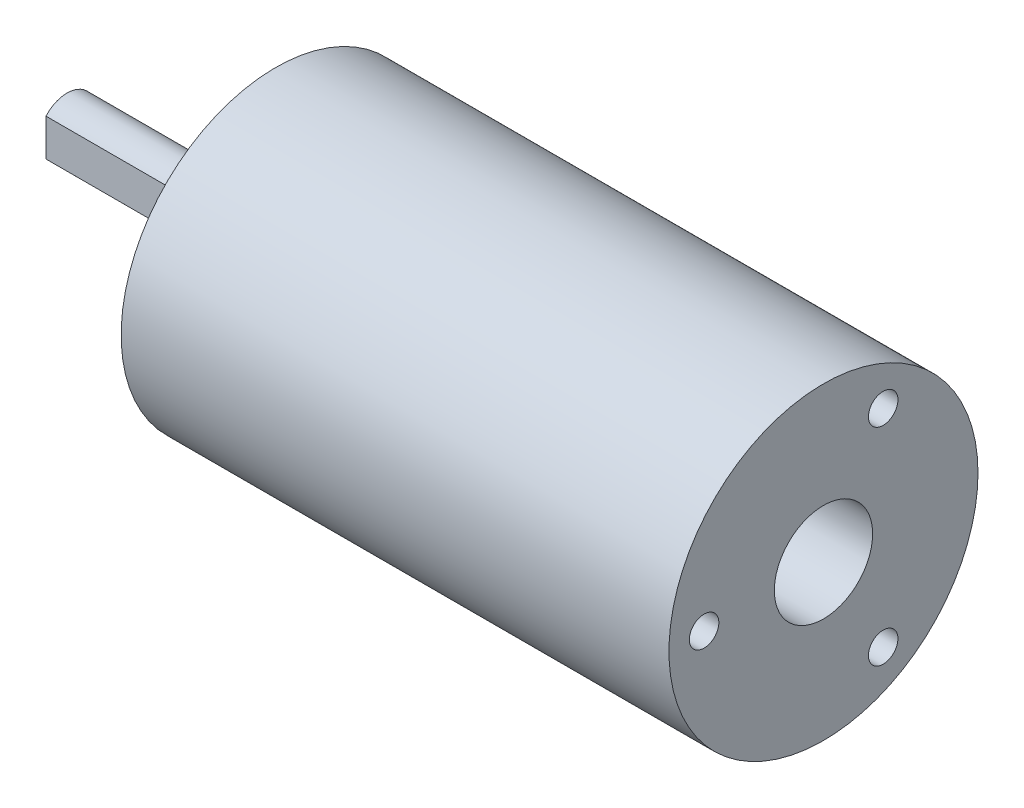
ISO-10303-21;
HEADER;
FILE_DESCRIPTION(('STEP AP214'),'2;1');
FILE_NAME('part.step','',(''),(''),'','','');
FILE_SCHEMA(('AUTOMOTIVE_DESIGN { 1 0 10303 214 1 1 1 1 }'));
ENDSEC;
DATA;
#1=APPLICATION_CONTEXT('core data for automotive mechanical design processes');
#2=APPLICATION_PROTOCOL_DEFINITION('international standard','automotive_design',2000,#1);
#3=PRODUCT_CONTEXT('',#1,'mechanical');
#4=PRODUCT('Part','Part','',(#3));
#5=PRODUCT_RELATED_PRODUCT_CATEGORY('part','',(#4));
#6=PRODUCT_DEFINITION_FORMATION('','',#4);
#7=PRODUCT_DEFINITION_CONTEXT('part definition',#1,'design');
#8=PRODUCT_DEFINITION('design','',#6,#7);
#9=PRODUCT_DEFINITION_SHAPE('','',#8);
#10=(LENGTH_UNIT() NAMED_UNIT(*) SI_UNIT(.MILLI.,.METRE.));
#11=(NAMED_UNIT(*) PLANE_ANGLE_UNIT() SI_UNIT($,.RADIAN.));
#12=(NAMED_UNIT(*) SI_UNIT($,.STERADIAN.) SOLID_ANGLE_UNIT());
#13=UNCERTAINTY_MEASURE_WITH_UNIT(LENGTH_MEASURE(1.E-05),#10,'distance_accuracy_value','');
#14=(GEOMETRIC_REPRESENTATION_CONTEXT(3) GLOBAL_UNCERTAINTY_ASSIGNED_CONTEXT((#13)) GLOBAL_UNIT_ASSIGNED_CONTEXT((#10,
#11,#12)) REPRESENTATION_CONTEXT('',''));
#15=CARTESIAN_POINT('',(0.,0.,0.));
#16=DIRECTION('',(0.,0.,1.));
#17=DIRECTION('',(1.,0.,0.));
#18=AXIS2_PLACEMENT_3D('',#15,#16,#17);
#19=CARTESIAN_POINT('',(-5.85,-1.32287565553,1.5));
#20=DIRECTION('',(-0.707106781186547,0.,0.707106781186548));
#21=DIRECTION('',(0.707106781186548,0.,0.707106781186547));
#22=AXIS2_PLACEMENT_3D('',#19,#20,#21);
#23=PLANE('',#22);
#24=CARTESIAN_POINT('',(-7.35,0.,0.));
#25=DIRECTION('',(-0.707106781186547,0.,0.707106781186548));
#26=DIRECTION('',(-0.707106781186548,0.,-0.707106781186547));
#27=AXIS2_PLACEMENT_3D('',#24,#25,#26);
#28=ELLIPSE('',#27,2.82842712474619,2.);
#29=CARTESIAN_POINT('',(-5.84999999999943,1.32287565553165,1.50000000000057));
#30=VERTEX_POINT('',#29);
#31=CARTESIAN_POINT('',(-5.84999999999943,-1.32287565553165,1.50000000000057));
#32=VERTEX_POINT('',#31);
#33=EDGE_CURVE('E19',#30,#32,#28,.F.);
#34=ORIENTED_EDGE('',*,*,#33,.F.);
#35=DIRECTION('',(0.,1.,0.));
#36=VECTOR('',#35,1.);
#37=CARTESIAN_POINT('',(-5.85,1.32287565553,1.5));
#38=LINE('',#37,#36);
#39=EDGE_CURVE('E40',#32,#30,#38,.T.);
#40=ORIENTED_EDGE('',*,*,#39,.F.);
#41=EDGE_LOOP('',(#34,#40));
#42=FACE_BOUND('',#41,.T.);
#43=ADVANCED_FACE('F16',(#42),#23,.T.);
#44=CARTESIAN_POINT('',(-14.85,1.32287565553,1.5));
#45=DIRECTION('',(0.,0.,1.));
#46=DIRECTION('',(1.,0.,0.));
#47=AXIS2_PLACEMENT_3D('',#44,#45,#46);
#48=PLANE('',#47);
#49=ORIENTED_EDGE('',*,*,#39,.T.);
#50=DIRECTION('',(-1.,0.,0.));
#51=VECTOR('',#50,1.);
#52=CARTESIAN_POINT('',(-3.14999999,1.322875655531,1.50000000000114));
#53=LINE('',#52,#51);
#54=CARTESIAN_POINT('',(-14.85,1.32287565553165,1.50000000000057));
#55=VERTEX_POINT('',#54);
#56=EDGE_CURVE('E44',#55,#30,#53,.F.);
#57=ORIENTED_EDGE('',*,*,#56,.F.);
#58=DIRECTION('',(0.,-1.,0.));
#59=VECTOR('',#58,1.);
#60=CARTESIAN_POINT('',(-14.85,1.32287565553,1.5));
#61=LINE('',#60,#59);
#62=CARTESIAN_POINT('',(-14.85,-1.32287565553165,1.50000000000057));
#63=VERTEX_POINT('',#62);
#64=EDGE_CURVE('E33',#63,#55,#61,.F.);
#65=ORIENTED_EDGE('',*,*,#64,.F.);
#66=DIRECTION('',(-1.,0.,0.));
#67=VECTOR('',#66,1.);
#68=CARTESIAN_POINT('',(-3.14999999,-1.322875655531,1.50000000000114));
#69=LINE('',#68,#67);
#70=EDGE_CURVE('E46',#32,#63,#69,.T.);
#71=ORIENTED_EDGE('',*,*,#70,.F.);
#72=EDGE_LOOP('',(#49,#57,#65,#71));
#73=FACE_BOUND('',#72,.T.);
#74=ADVANCED_FACE('F42',(#73),#48,.T.);
#75=CARTESIAN_POINT('',(-14.85,1.32287565553,1.5));
#76=DIRECTION('',(-1.,0.,0.));
#77=DIRECTION('',(0.,-1.,0.));
#78=AXIS2_PLACEMENT_3D('',#75,#76,#77);
#79=PLANE('',#78);
#80=ORIENTED_EDGE('',*,*,#64,.T.);
#81=CARTESIAN_POINT('',(-14.85,0.,0.));
#82=DIRECTION('',(-1.,0.,0.));
#83=DIRECTION('',(0.,0.,1.));
#84=AXIS2_PLACEMENT_3D('',#81,#82,#83);
#85=CIRCLE('',#84,2.);
#86=EDGE_CURVE('E53',#63,#55,#85,.F.);
#87=ORIENTED_EDGE('',*,*,#86,.F.);
#88=EDGE_LOOP('',(#80,#87));
#89=FACE_BOUND('',#88,.T.);
#90=ADVANCED_FACE('F122',(#89),#79,.T.);
#91=CARTESIAN_POINT('',(-3.14999999,0.,0.));
#92=DIRECTION('',(-1.,0.,0.));
#93=DIRECTION('',(0.,0.,1.));
#94=AXIS2_PLACEMENT_3D('',#91,#92,#93);
#95=CYLINDRICAL_SURFACE('',#94,2.);
#96=CARTESIAN_POINT('',(-3.15,0.,0.));
#97=DIRECTION('',(-1.,0.,0.));
#98=DIRECTION('',(0.,0.,1.));
#99=AXIS2_PLACEMENT_3D('',#96,#97,#98);
#100=CIRCLE('',#99,2.);
#101=CARTESIAN_POINT('',(-3.15,0.,2.));
#102=VERTEX_POINT('',#101);
#103=EDGE_CURVE('E114',#102,#102,#100,.F.);
#104=ORIENTED_EDGE('',*,*,#103,.F.);
#105=EDGE_LOOP('',(#104));
#106=FACE_BOUND('',#105,.T.);
#107=ORIENTED_EDGE('',*,*,#70,.T.);
#108=ORIENTED_EDGE('',*,*,#86,.T.);
#109=ORIENTED_EDGE('',*,*,#56,.T.);
#110=ORIENTED_EDGE('',*,*,#33,.T.);
#111=EDGE_LOOP('',(#107,#108,#109,#110));
#112=FACE_BOUND('',#111,.T.);
#113=ADVANCED_FACE('F52',(#106,#112),#95,.T.);
#114=CARTESIAN_POINT('',(-3.15,-3.5,0.));
#115=DIRECTION('',(-1.,0.,0.));
#116=DIRECTION('',(0.,-1.,0.));
#117=AXIS2_PLACEMENT_3D('',#114,#115,#116);
#118=PLANE('',#117);
#119=ORIENTED_EDGE('',*,*,#103,.T.);
#120=EDGE_LOOP('',(#119));
#121=FACE_BOUND('',#120,.T.);
#122=CARTESIAN_POINT('',(-3.15,0.,0.));
#123=DIRECTION('',(-1.,0.,0.));
#124=DIRECTION('',(0.,-1.,0.));
#125=AXIS2_PLACEMENT_3D('',#122,#123,#124);
#126=CIRCLE('',#125,3.5);
#127=CARTESIAN_POINT('',(-3.15,-3.5,0.));
#128=VERTEX_POINT('',#127);
#129=EDGE_CURVE('E111',#128,#128,#126,.F.);
#130=ORIENTED_EDGE('',*,*,#129,.F.);
#131=EDGE_LOOP('',(#130));
#132=FACE_BOUND('',#131,.T.);
#133=ADVANCED_FACE('F118',(#121,#132),#118,.T.);
#134=CARTESIAN_POINT('',(-1.34999999,0.,0.));
#135=DIRECTION('',(-1.,0.,0.));
#136=DIRECTION('',(0.,-1.,0.));
#137=AXIS2_PLACEMENT_3D('',#134,#135,#136);
#138=CYLINDRICAL_SURFACE('',#137,3.5);
#139=ORIENTED_EDGE('',*,*,#129,.T.);
#140=EDGE_LOOP('',(#139));
#141=FACE_BOUND('',#140,.T.);
#142=CARTESIAN_POINT('',(-1.35,0.,0.));
#143=DIRECTION('',(-1.,0.,0.));
#144=DIRECTION('',(0.,-1.,0.));
#145=AXIS2_PLACEMENT_3D('',#142,#143,#144);
#146=CIRCLE('',#145,3.5);
#147=CARTESIAN_POINT('',(-1.35,-3.5,0.));
#148=VERTEX_POINT('',#147);
#149=EDGE_CURVE('E108',#148,#148,#146,.F.);
#150=ORIENTED_EDGE('',*,*,#149,.F.);
#151=EDGE_LOOP('',(#150));
#152=FACE_BOUND('',#151,.T.);
#153=ADVANCED_FACE('F129',(#141,#152),#138,.T.);
#154=CARTESIAN_POINT('',(36.,7.88621593217,-3.34067332603));
#155=DIRECTION('',(1.,0.,0.));
#156=DIRECTION('',(0.,0.,-1.));
#157=AXIS2_PLACEMENT_3D('',#154,#155,#156);
#158=PLANE('',#157);
#159=CARTESIAN_POINT('',(36.,7.36121593217,-4.25));
#160=DIRECTION('',(-1.,0.,0.));
#161=DIRECTION('',(0.,-1.,0.));
#162=AXIS2_PLACEMENT_3D('',#159,#160,#161);
#163=CIRCLE('',#162,1.05);
#164=CARTESIAN_POINT('',(36.,6.31121593217,-4.25));
#165=VERTEX_POINT('',#164);
#166=EDGE_CURVE('E105',#165,#165,#163,.F.);
#167=ORIENTED_EDGE('',*,*,#166,.T.);
#168=EDGE_LOOP('',(#167));
#169=FACE_BOUND('',#168,.T.);
#170=ADVANCED_FACE('F208',(#169),#158,.T.);
#171=CARTESIAN_POINT('',(36.,-6.83621593217,-5.15932667397));
#172=DIRECTION('',(1.,0.,0.));
#173=DIRECTION('',(0.,0.,-1.));
#174=AXIS2_PLACEMENT_3D('',#171,#172,#173);
#175=PLANE('',#174);
#176=CARTESIAN_POINT('',(36.,-7.36121593217,-4.25));
#177=DIRECTION('',(-1.,0.,0.));
#178=DIRECTION('',(0.,-1.,0.));
#179=AXIS2_PLACEMENT_3D('',#176,#177,#178);
#180=CIRCLE('',#179,1.05);
#181=CARTESIAN_POINT('',(36.,-8.41121593217,-4.25));
#182=VERTEX_POINT('',#181);
#183=EDGE_CURVE('E102',#182,#182,#180,.F.);
#184=ORIENTED_EDGE('',*,*,#183,.T.);
#185=EDGE_LOOP('',(#184));
#186=FACE_BOUND('',#185,.T.);
#187=ADVANCED_FACE('F204',(#186),#175,.T.);
#188=CARTESIAN_POINT('',(36.,1.05,8.5));
#189=DIRECTION('',(1.,0.,0.));
#190=DIRECTION('',(0.,0.,-1.));
#191=AXIS2_PLACEMENT_3D('',#188,#189,#190);
#192=PLANE('',#191);
#193=CARTESIAN_POINT('',(36.,0.,8.5));
#194=DIRECTION('',(-1.,0.,0.));
#195=DIRECTION('',(0.,-1.,0.));
#196=AXIS2_PLACEMENT_3D('',#193,#194,#195);
#197=CIRCLE('',#196,1.05);
#198=CARTESIAN_POINT('',(36.,-1.05,8.5));
#199=VERTEX_POINT('',#198);
#200=EDGE_CURVE('E99',#199,#199,#197,.F.);
#201=ORIENTED_EDGE('',*,*,#200,.T.);
#202=EDGE_LOOP('',(#201));
#203=FACE_BOUND('',#202,.T.);
#204=ADVANCED_FACE('F200',(#203),#192,.T.);
#205=CARTESIAN_POINT('',(32.6,3.5,0.));
#206=DIRECTION('',(1.,0.,0.));
#207=DIRECTION('',(0.,0.,-1.));
#208=AXIS2_PLACEMENT_3D('',#205,#206,#207);
#209=PLANE('',#208);
#210=CARTESIAN_POINT('',(32.6,0.,0.));
#211=DIRECTION('',(-1.,0.,0.));
#212=DIRECTION('',(0.,-1.,0.));
#213=AXIS2_PLACEMENT_3D('',#210,#211,#212);
#214=CIRCLE('',#213,3.5);
#215=CARTESIAN_POINT('',(32.6,-3.5,0.));
#216=VERTEX_POINT('',#215);
#217=EDGE_CURVE('E96',#216,#216,#214,.F.);
#218=ORIENTED_EDGE('',*,*,#217,.T.);
#219=EDGE_LOOP('',(#218));
#220=FACE_BOUND('',#219,.T.);
#221=ADVANCED_FACE('F196',(#220),#209,.T.);
#222=CARTESIAN_POINT('',(6.5,6.54967782649,-2.65562523131));
#223=DIRECTION('',(-1.,0.,0.));
#224=DIRECTION('',(0.,-1.,0.));
#225=AXIS2_PLACEMENT_3D('',#222,#223,#224);
#226=PLANE('',#225);
#227=CARTESIAN_POINT('',(6.5,6.06217782649,-3.5));
#228=DIRECTION('',(1.,0.,0.));
#229=DIRECTION('',(0.,0.,-1.));
#230=AXIS2_PLACEMENT_3D('',#227,#228,#229);
#231=CIRCLE('',#230,0.975);
#232=CARTESIAN_POINT('',(6.5,6.06217782649,-4.475));
#233=VERTEX_POINT('',#232);
#234=EDGE_CURVE('E93',#233,#233,#231,.F.);
#235=ORIENTED_EDGE('',*,*,#234,.T.);
#236=EDGE_LOOP('',(#235));
#237=FACE_BOUND('',#236,.T.);
#238=ADVANCED_FACE('F192',(#237),#226,.T.);
#239=CARTESIAN_POINT('',(6.5,-5.57467782649,-4.34437476869));
#240=DIRECTION('',(-1.,0.,0.));
#241=DIRECTION('',(0.,-1.,0.));
#242=AXIS2_PLACEMENT_3D('',#239,#240,#241);
#243=PLANE('',#242);
#244=CARTESIAN_POINT('',(6.5,-6.06217782649,-3.5));
#245=DIRECTION('',(1.,0.,0.));
#246=DIRECTION('',(0.,0.,-1.));
#247=AXIS2_PLACEMENT_3D('',#244,#245,#246);
#248=CIRCLE('',#247,0.975);
#249=CARTESIAN_POINT('',(6.5,-6.06217782649,-4.475));
#250=VERTEX_POINT('',#249);
#251=EDGE_CURVE('E90',#250,#250,#248,.F.);
#252=ORIENTED_EDGE('',*,*,#251,.T.);
#253=EDGE_LOOP('',(#252));
#254=FACE_BOUND('',#253,.T.);
#255=ADVANCED_FACE('F188',(#254),#243,.T.);
#256=CARTESIAN_POINT('',(6.5,0.975,7.));
#257=DIRECTION('',(-1.,0.,0.));
#258=DIRECTION('',(0.,-1.,0.));
#259=AXIS2_PLACEMENT_3D('',#256,#257,#258);
#260=PLANE('',#259);
#261=CARTESIAN_POINT('',(6.5,0.,7.));
#262=DIRECTION('',(1.,0.,0.));
#263=DIRECTION('',(0.,0.,-1.));
#264=AXIS2_PLACEMENT_3D('',#261,#262,#263);
#265=CIRCLE('',#264,0.975);
#266=CARTESIAN_POINT('',(6.5,0.,6.025));
#267=VERTEX_POINT('',#266);
#268=EDGE_CURVE('E87',#267,#267,#265,.F.);
#269=ORIENTED_EDGE('',*,*,#268,.T.);
#270=EDGE_LOOP('',(#269));
#271=FACE_BOUND('',#270,.T.);
#272=ADVANCED_FACE('F184',(#271),#260,.T.);
#273=CARTESIAN_POINT('',(-1.35,5.,0.));
#274=DIRECTION('',(-1.,0.,0.));
#275=DIRECTION('',(0.,-1.,0.));
#276=AXIS2_PLACEMENT_3D('',#273,#274,#275);
#277=PLANE('',#276);
#278=ORIENTED_EDGE('',*,*,#149,.T.);
#279=EDGE_LOOP('',(#278));
#280=FACE_BOUND('',#279,.T.);
#281=CARTESIAN_POINT('',(-1.35,0.,0.));
#282=DIRECTION('',(1.,0.,0.));
#283=DIRECTION('',(0.,0.,-1.));
#284=AXIS2_PLACEMENT_3D('',#281,#282,#283);
#285=CIRCLE('',#284,5.);
#286=CARTESIAN_POINT('',(-1.35,0.,-5.));
#287=VERTEX_POINT('',#286);
#288=EDGE_CURVE('E84',#287,#287,#285,.T.);
#289=ORIENTED_EDGE('',*,*,#288,.F.);
#290=EDGE_LOOP('',(#289));
#291=FACE_BOUND('',#290,.T.);
#292=ADVANCED_FACE('F180',(#280,#291),#277,.T.);
#293=CARTESIAN_POINT('',(39.00000001,7.36121593217,-4.25));
#294=DIRECTION('',(-1.,0.,0.));
#295=DIRECTION('',(0.,-1.,0.));
#296=AXIS2_PLACEMENT_3D('',#293,#294,#295);
#297=CYLINDRICAL_SURFACE('',#296,1.05);
#298=ORIENTED_EDGE('',*,*,#166,.F.);
#299=EDGE_LOOP('',(#298));
#300=FACE_BOUND('',#299,.T.);
#301=CARTESIAN_POINT('',(39.,7.36121593217,-4.25));
#302=DIRECTION('',(-1.,0.,0.));
#303=DIRECTION('',(0.,-1.,0.));
#304=AXIS2_PLACEMENT_3D('',#301,#302,#303);
#305=CIRCLE('',#304,1.05);
#306=CARTESIAN_POINT('',(39.,6.31121593217,-4.25));
#307=VERTEX_POINT('',#306);
#308=EDGE_CURVE('E81',#307,#307,#305,.T.);
#309=ORIENTED_EDGE('',*,*,#308,.F.);
#310=EDGE_LOOP('',(#309));
#311=FACE_BOUND('',#310,.T.);
#312=ADVANCED_FACE('F176',(#300,#311),#297,.F.);
#313=CARTESIAN_POINT('',(39.00000001,-7.36121593217,-4.25));
#314=DIRECTION('',(-1.,0.,0.));
#315=DIRECTION('',(0.,-1.,0.));
#316=AXIS2_PLACEMENT_3D('',#313,#314,#315);
#317=CYLINDRICAL_SURFACE('',#316,1.05);
#318=ORIENTED_EDGE('',*,*,#183,.F.);
#319=EDGE_LOOP('',(#318));
#320=FACE_BOUND('',#319,.T.);
#321=CARTESIAN_POINT('',(39.,-7.36121593217,-4.25));
#322=DIRECTION('',(-1.,0.,0.));
#323=DIRECTION('',(0.,-1.,0.));
#324=AXIS2_PLACEMENT_3D('',#321,#322,#323);
#325=CIRCLE('',#324,1.05);
#326=CARTESIAN_POINT('',(39.,-8.41121593217,-4.25));
#327=VERTEX_POINT('',#326);
#328=EDGE_CURVE('E78',#327,#327,#325,.T.);
#329=ORIENTED_EDGE('',*,*,#328,.F.);
#330=EDGE_LOOP('',(#329));
#331=FACE_BOUND('',#330,.T.);
#332=ADVANCED_FACE('F172',(#320,#331),#317,.F.);
#333=CARTESIAN_POINT('',(39.00000001,0.,8.5));
#334=DIRECTION('',(-1.,0.,0.));
#335=DIRECTION('',(0.,-1.,0.));
#336=AXIS2_PLACEMENT_3D('',#333,#334,#335);
#337=CYLINDRICAL_SURFACE('',#336,1.05);
#338=ORIENTED_EDGE('',*,*,#200,.F.);
#339=EDGE_LOOP('',(#338));
#340=FACE_BOUND('',#339,.T.);
#341=CARTESIAN_POINT('',(39.,0.,8.5));
#342=DIRECTION('',(-1.,0.,0.));
#343=DIRECTION('',(0.,-1.,0.));
#344=AXIS2_PLACEMENT_3D('',#341,#342,#343);
#345=CIRCLE('',#344,1.05);
#346=CARTESIAN_POINT('',(39.,-1.05,8.5));
#347=VERTEX_POINT('',#346);
#348=EDGE_CURVE('E75',#347,#347,#345,.T.);
#349=ORIENTED_EDGE('',*,*,#348,.F.);
#350=EDGE_LOOP('',(#349));
#351=FACE_BOUND('',#350,.T.);
#352=ADVANCED_FACE('F168',(#340,#351),#337,.F.);
#353=CARTESIAN_POINT('',(39.00000001,0.,0.));
#354=DIRECTION('',(-1.,0.,0.));
#355=DIRECTION('',(0.,-1.,0.));
#356=AXIS2_PLACEMENT_3D('',#353,#354,#355);
#357=CYLINDRICAL_SURFACE('',#356,3.5);
#358=ORIENTED_EDGE('',*,*,#217,.F.);
#359=EDGE_LOOP('',(#358));
#360=FACE_BOUND('',#359,.T.);
#361=CARTESIAN_POINT('',(39.,0.,0.));
#362=DIRECTION('',(-1.,0.,0.));
#363=DIRECTION('',(0.,-1.,0.));
#364=AXIS2_PLACEMENT_3D('',#361,#362,#363);
#365=CIRCLE('',#364,3.5);
#366=CARTESIAN_POINT('',(39.,-3.5,0.));
#367=VERTEX_POINT('',#366);
#368=EDGE_CURVE('E72',#367,#367,#365,.T.);
#369=ORIENTED_EDGE('',*,*,#368,.F.);
#370=EDGE_LOOP('',(#369));
#371=FACE_BOUND('',#370,.T.);
#372=ADVANCED_FACE('F164',(#360,#371),#357,.F.);
#373=CARTESIAN_POINT('',(-9.99999993922529E-09,6.06217782649,-3.5));
#374=DIRECTION('',(1.,0.,0.));
#375=DIRECTION('',(0.,0.,-1.));
#376=AXIS2_PLACEMENT_3D('',#373,#374,#375);
#377=CYLINDRICAL_SURFACE('',#376,0.975);
#378=ORIENTED_EDGE('',*,*,#234,.F.);
#379=EDGE_LOOP('',(#378));
#380=FACE_BOUND('',#379,.T.);
#381=CARTESIAN_POINT('',(0.,6.06217782649,-3.5));
#382=DIRECTION('',(1.,0.,0.));
#383=DIRECTION('',(0.,0.,-1.));
#384=AXIS2_PLACEMENT_3D('',#381,#382,#383);
#385=CIRCLE('',#384,0.975);
#386=CARTESIAN_POINT('',(0.,6.06217782649,-4.475));
#387=VERTEX_POINT('',#386);
#388=EDGE_CURVE('E69',#387,#387,#385,.T.);
#389=ORIENTED_EDGE('',*,*,#388,.F.);
#390=EDGE_LOOP('',(#389));
#391=FACE_BOUND('',#390,.T.);
#392=ADVANCED_FACE('F160',(#380,#391),#377,.F.);
#393=CARTESIAN_POINT('',(-9.99999993922529E-09,-6.06217782649,-3.5));
#394=DIRECTION('',(1.,0.,0.));
#395=DIRECTION('',(0.,0.,-1.));
#396=AXIS2_PLACEMENT_3D('',#393,#394,#395);
#397=CYLINDRICAL_SURFACE('',#396,0.975);
#398=ORIENTED_EDGE('',*,*,#251,.F.);
#399=EDGE_LOOP('',(#398));
#400=FACE_BOUND('',#399,.T.);
#401=CARTESIAN_POINT('',(0.,-6.06217782649,-3.5));
#402=DIRECTION('',(1.,0.,0.));
#403=DIRECTION('',(0.,0.,-1.));
#404=AXIS2_PLACEMENT_3D('',#401,#402,#403);
#405=CIRCLE('',#404,0.975);
#406=CARTESIAN_POINT('',(0.,-6.06217782649,-4.475));
#407=VERTEX_POINT('',#406);
#408=EDGE_CURVE('E66',#407,#407,#405,.T.);
#409=ORIENTED_EDGE('',*,*,#408,.F.);
#410=EDGE_LOOP('',(#409));
#411=FACE_BOUND('',#410,.T.);
#412=ADVANCED_FACE('F156',(#400,#411),#397,.F.);
#413=CARTESIAN_POINT('',(-9.99999993922529E-09,0.,7.));
#414=DIRECTION('',(1.,0.,0.));
#415=DIRECTION('',(0.,0.,-1.));
#416=AXIS2_PLACEMENT_3D('',#413,#414,#415);
#417=CYLINDRICAL_SURFACE('',#416,0.975);
#418=ORIENTED_EDGE('',*,*,#268,.F.);
#419=EDGE_LOOP('',(#418));
#420=FACE_BOUND('',#419,.T.);
#421=CARTESIAN_POINT('',(0.,0.,7.));
#422=DIRECTION('',(1.,0.,0.));
#423=DIRECTION('',(0.,0.,-1.));
#424=AXIS2_PLACEMENT_3D('',#421,#422,#423);
#425=CIRCLE('',#424,0.975);
#426=CARTESIAN_POINT('',(0.,0.,6.025));
#427=VERTEX_POINT('',#426);
#428=EDGE_CURVE('E63',#427,#427,#425,.T.);
#429=ORIENTED_EDGE('',*,*,#428,.F.);
#430=EDGE_LOOP('',(#429));
#431=FACE_BOUND('',#430,.T.);
#432=ADVANCED_FACE('F152',(#420,#431),#417,.F.);
#433=CARTESIAN_POINT('',(-1.35000001,0.,0.));
#434=DIRECTION('',(1.,0.,0.));
#435=DIRECTION('',(0.,0.,-1.));
#436=AXIS2_PLACEMENT_3D('',#433,#434,#435);
#437=CYLINDRICAL_SURFACE('',#436,5.);
#438=ORIENTED_EDGE('',*,*,#288,.T.);
#439=EDGE_LOOP('',(#438));
#440=FACE_BOUND('',#439,.T.);
#441=CARTESIAN_POINT('',(0.,0.,0.));
#442=DIRECTION('',(1.,0.,0.));
#443=DIRECTION('',(0.,0.,-1.));
#444=AXIS2_PLACEMENT_3D('',#441,#442,#443);
#445=CIRCLE('',#444,5.);
#446=CARTESIAN_POINT('',(0.,0.,-5.));
#447=VERTEX_POINT('',#446);
#448=EDGE_CURVE('E60',#447,#447,#445,.T.);
#449=ORIENTED_EDGE('',*,*,#448,.F.);
#450=EDGE_LOOP('',(#449));
#451=FACE_BOUND('',#450,.T.);
#452=ADVANCED_FACE('F148',(#440,#451),#437,.T.);
#453=CARTESIAN_POINT('',(39.,0.,11.));
#454=DIRECTION('',(1.,0.,0.));
#455=DIRECTION('',(0.,0.,-1.));
#456=AXIS2_PLACEMENT_3D('',#453,#454,#455);
#457=PLANE('',#456);
#458=ORIENTED_EDGE('',*,*,#368,.T.);
#459=EDGE_LOOP('',(#458));
#460=FACE_BOUND('',#459,.T.);
#461=ORIENTED_EDGE('',*,*,#348,.T.);
#462=EDGE_LOOP('',(#461));
#463=FACE_BOUND('',#462,.T.);
#464=ORIENTED_EDGE('',*,*,#328,.T.);
#465=EDGE_LOOP('',(#464));
#466=FACE_BOUND('',#465,.T.);
#467=ORIENTED_EDGE('',*,*,#308,.T.);
#468=EDGE_LOOP('',(#467));
#469=FACE_BOUND('',#468,.T.);
#470=CARTESIAN_POINT('',(39.,0.,0.));
#471=DIRECTION('',(1.,0.,0.));
#472=DIRECTION('',(0.,0.,-1.));
#473=AXIS2_PLACEMENT_3D('',#470,#471,#472);
#474=CIRCLE('',#473,11.);
#475=CARTESIAN_POINT('',(39.,0.,-11.));
#476=VERTEX_POINT('',#475);
#477=EDGE_CURVE('E25',#476,#476,#474,.F.);
#478=ORIENTED_EDGE('',*,*,#477,.F.);
#479=EDGE_LOOP('',(#478));
#480=FACE_BOUND('',#479,.T.);
#481=ADVANCED_FACE('F141',(#460,#463,#466,#469,#480),#457,.T.);
#482=CARTESIAN_POINT('',(0.,0.,11.));
#483=DIRECTION('',(-1.,0.,0.));
#484=DIRECTION('',(0.,-1.,0.));
#485=AXIS2_PLACEMENT_3D('',#482,#483,#484);
#486=PLANE('',#485);
#487=ORIENTED_EDGE('',*,*,#448,.T.);
#488=EDGE_LOOP('',(#487));
#489=FACE_BOUND('',#488,.T.);
#490=ORIENTED_EDGE('',*,*,#428,.T.);
#491=EDGE_LOOP('',(#490));
#492=FACE_BOUND('',#491,.T.);
#493=ORIENTED_EDGE('',*,*,#408,.T.);
#494=EDGE_LOOP('',(#493));
#495=FACE_BOUND('',#494,.T.);
#496=ORIENTED_EDGE('',*,*,#388,.T.);
#497=EDGE_LOOP('',(#496));
#498=FACE_BOUND('',#497,.T.);
#499=CARTESIAN_POINT('',(0.,0.,0.));
#500=DIRECTION('',(1.,0.,0.));
#501=DIRECTION('',(0.,0.,-1.));
#502=AXIS2_PLACEMENT_3D('',#499,#500,#501);
#503=CIRCLE('',#502,11.);
#504=CARTESIAN_POINT('',(0.,0.,-11.));
#505=VERTEX_POINT('',#504);
#506=EDGE_CURVE('E11',#505,#505,#503,.T.);
#507=ORIENTED_EDGE('',*,*,#506,.F.);
#508=EDGE_LOOP('',(#507));
#509=FACE_BOUND('',#508,.T.);
#510=ADVANCED_FACE('F135',(#489,#492,#495,#498,#509),#486,.T.);
#511=CARTESIAN_POINT('',(1.59999999,0.,0.));
#512=DIRECTION('',(1.,0.,0.));
#513=DIRECTION('',(0.,0.,-1.));
#514=AXIS2_PLACEMENT_3D('',#511,#512,#513);
#515=CYLINDRICAL_SURFACE('',#514,11.);
#516=ORIENTED_EDGE('',*,*,#506,.T.);
#517=EDGE_LOOP('',(#516));
#518=FACE_BOUND('',#517,.T.);
#519=ORIENTED_EDGE('',*,*,#477,.T.);
#520=EDGE_LOOP('',(#519));
#521=FACE_BOUND('',#520,.T.);
#522=ADVANCED_FACE('F133',(#518,#521),#515,.T.);
#523=CLOSED_SHELL('',(#43,#74,#90,#113,#133,#153,#170,#187,#204,#221,#238,#255,#272,#292,#312,
#332,#352,#372,#392,#412,#432,#452,#481,#510,#522));
#524=MANIFOLD_SOLID_BREP('B1',#523);
#525=ADVANCED_BREP_SHAPE_REPRESENTATION('',(#18,#524),#14);
#526=SHAPE_DEFINITION_REPRESENTATION(#9,#525);
ENDSEC;
END-ISO-10303-21;
